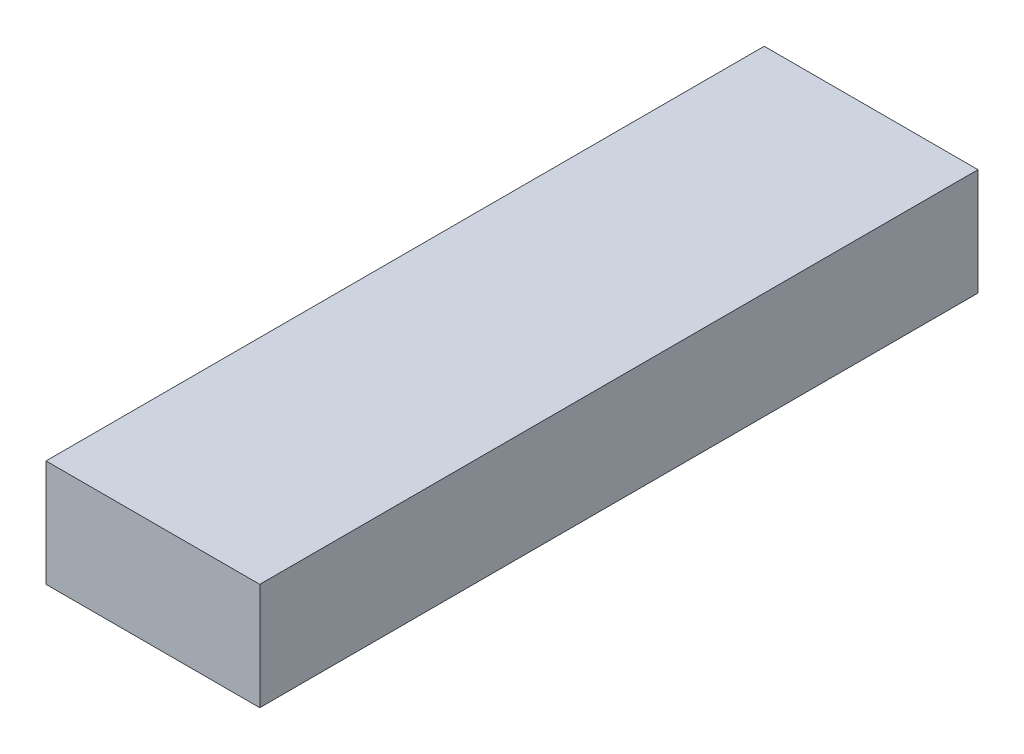
ISO-10303-21;
HEADER;
FILE_DESCRIPTION(('STEP AP214'),'2;1');
FILE_NAME('part.step','',(''),(''),'','','');
FILE_SCHEMA(('AUTOMOTIVE_DESIGN { 1 0 10303 214 1 1 1 1 }'));
ENDSEC;
DATA;
#1=APPLICATION_CONTEXT('core data for automotive mechanical design processes');
#2=APPLICATION_PROTOCOL_DEFINITION('international standard','automotive_design',2000,#1);
#3=PRODUCT_CONTEXT('',#1,'mechanical');
#4=PRODUCT('Part','Part','',(#3));
#5=PRODUCT_RELATED_PRODUCT_CATEGORY('part','',(#4));
#6=PRODUCT_DEFINITION_FORMATION('','',#4);
#7=PRODUCT_DEFINITION_CONTEXT('part definition',#1,'design');
#8=PRODUCT_DEFINITION('design','',#6,#7);
#9=PRODUCT_DEFINITION_SHAPE('','',#8);
#10=(LENGTH_UNIT() NAMED_UNIT(*) SI_UNIT(.MILLI.,.METRE.));
#11=(NAMED_UNIT(*) PLANE_ANGLE_UNIT() SI_UNIT($,.RADIAN.));
#12=(NAMED_UNIT(*) SI_UNIT($,.STERADIAN.) SOLID_ANGLE_UNIT());
#13=UNCERTAINTY_MEASURE_WITH_UNIT(LENGTH_MEASURE(1.E-05),#10,'distance_accuracy_value','');
#14=(GEOMETRIC_REPRESENTATION_CONTEXT(3) GLOBAL_UNCERTAINTY_ASSIGNED_CONTEXT((#13)) GLOBAL_UNIT_ASSIGNED_CONTEXT((#10,
#11,#12)) REPRESENTATION_CONTEXT('',''));
#15=CARTESIAN_POINT('',(0.,0.,0.));
#16=DIRECTION('',(0.,0.,1.));
#17=DIRECTION('',(1.,0.,0.));
#18=AXIS2_PLACEMENT_3D('',#15,#16,#17);
#19=CARTESIAN_POINT('',(2.97165317919075,3.175,-4.8671098265896));
#20=DIRECTION('',(0.,0.,1.));
#21=DIRECTION('',(1.,0.,0.));
#22=AXIS2_PLACEMENT_3D('',#19,#20,#21);
#23=PLANE('',#22);
#24=DIRECTION('',(-1.,0.,0.));
#25=VECTOR('',#24,1.);
#26=CARTESIAN_POINT('',(2.97165317919075,0.,-4.8671098265896));
#27=LINE('',#26,#25);
#28=CARTESIAN_POINT('',(2.97165317919075,0.,-4.8671098265896));
#29=VERTEX_POINT('',#28);
#30=CARTESIAN_POINT('',(-3.37834682080925,0.,-4.8671098265896));
#31=VERTEX_POINT('',#30);
#32=EDGE_CURVE('E96',#29,#31,#27,.T.);
#33=ORIENTED_EDGE('',*,*,#32,.T.);
#34=DIRECTION('',(0.,-1.,0.));
#35=VECTOR('',#34,1.);
#36=CARTESIAN_POINT('',(-3.37834682080925,3.175,-4.8671098265896));
#37=LINE('',#36,#35);
#38=CARTESIAN_POINT('',(-3.37834682080925,3.175,-4.8671098265896));
#39=VERTEX_POINT('',#38);
#40=EDGE_CURVE('E11',#39,#31,#37,.T.);
#41=ORIENTED_EDGE('',*,*,#40,.F.);
#42=DIRECTION('',(-1.,0.,0.));
#43=VECTOR('',#42,1.);
#44=CARTESIAN_POINT('',(2.97165317919075,3.175,-4.8671098265896));
#45=LINE('',#44,#43);
#46=CARTESIAN_POINT('',(2.97165317919075,3.175,-4.8671098265896));
#47=VERTEX_POINT('',#46);
#48=EDGE_CURVE('E84',#47,#39,#45,.T.);
#49=ORIENTED_EDGE('',*,*,#48,.F.);
#50=DIRECTION('',(0.,-1.,0.));
#51=VECTOR('',#50,1.);
#52=CARTESIAN_POINT('',(2.97165317919075,3.175,-4.8671098265896));
#53=LINE('',#52,#51);
#54=EDGE_CURVE('E92',#47,#29,#53,.T.);
#55=ORIENTED_EDGE('',*,*,#54,.T.);
#56=EDGE_LOOP('',(#33,#41,#49,#55));
#57=FACE_BOUND('',#56,.T.);
#58=ADVANCED_FACE('F33',(#57),#23,.F.);
#59=CARTESIAN_POINT('',(-3.37834682080925,3.175,-4.8671098265896));
#60=DIRECTION('',(1.,0.,0.));
#61=DIRECTION('',(0.,0.,-1.));
#62=AXIS2_PLACEMENT_3D('',#59,#60,#61);
#63=PLANE('',#62);
#64=DIRECTION('',(0.,0.,1.));
#65=VECTOR('',#64,1.);
#66=CARTESIAN_POINT('',(-3.37834682080925,0.,-4.8671098265896));
#67=LINE('',#66,#65);
#68=CARTESIAN_POINT('',(-3.37834682080925,0.,16.4688901734104));
#69=VERTEX_POINT('',#68);
#70=EDGE_CURVE('E88',#31,#69,#67,.T.);
#71=ORIENTED_EDGE('',*,*,#70,.T.);
#72=DIRECTION('',(0.,-1.,0.));
#73=VECTOR('',#72,1.);
#74=CARTESIAN_POINT('',(-3.37834682080925,3.175,16.4688901734104));
#75=LINE('',#74,#73);
#76=CARTESIAN_POINT('',(-3.37834682080925,3.175,16.4688901734104));
#77=VERTEX_POINT('',#76);
#78=EDGE_CURVE('E41',#77,#69,#75,.T.);
#79=ORIENTED_EDGE('',*,*,#78,.F.);
#80=DIRECTION('',(0.,0.,1.));
#81=VECTOR('',#80,1.);
#82=CARTESIAN_POINT('',(-3.37834682080925,3.175,-4.8671098265896));
#83=LINE('',#82,#81);
#84=EDGE_CURVE('E79',#39,#77,#83,.T.);
#85=ORIENTED_EDGE('',*,*,#84,.F.);
#86=ORIENTED_EDGE('',*,*,#40,.T.);
#87=EDGE_LOOP('',(#71,#79,#85,#86));
#88=FACE_BOUND('',#87,.T.);
#89=ADVANCED_FACE('F87',(#88),#63,.F.);
#90=CARTESIAN_POINT('',(-3.37834682080925,3.175,16.4688901734104));
#91=DIRECTION('',(0.,0.,-1.));
#92=DIRECTION('',(-1.,0.,0.));
#93=AXIS2_PLACEMENT_3D('',#90,#91,#92);
#94=PLANE('',#93);
#95=DIRECTION('',(1.,0.,0.));
#96=VECTOR('',#95,1.);
#97=CARTESIAN_POINT('',(-3.37834682080925,0.,16.4688901734104));
#98=LINE('',#97,#96);
#99=CARTESIAN_POINT('',(2.97165317919075,0.,16.4688901734104));
#100=VERTEX_POINT('',#99);
#101=EDGE_CURVE('E66',#69,#100,#98,.T.);
#102=ORIENTED_EDGE('',*,*,#101,.T.);
#103=DIRECTION('',(0.,-1.,0.));
#104=VECTOR('',#103,1.);
#105=CARTESIAN_POINT('',(2.97165317919075,3.175,16.4688901734104));
#106=LINE('',#105,#104);
#107=CARTESIAN_POINT('',(2.97165317919075,3.175,16.4688901734104));
#108=VERTEX_POINT('',#107);
#109=EDGE_CURVE('E89',#108,#100,#106,.T.);
#110=ORIENTED_EDGE('',*,*,#109,.F.);
#111=DIRECTION('',(1.,0.,0.));
#112=VECTOR('',#111,1.);
#113=CARTESIAN_POINT('',(-3.37834682080925,3.175,16.4688901734104));
#114=LINE('',#113,#112);
#115=EDGE_CURVE('E82',#77,#108,#114,.T.);
#116=ORIENTED_EDGE('',*,*,#115,.F.);
#117=ORIENTED_EDGE('',*,*,#78,.T.);
#118=EDGE_LOOP('',(#102,#110,#116,#117));
#119=FACE_BOUND('',#118,.T.);
#120=ADVANCED_FACE('F90',(#119),#94,.F.);
#121=CARTESIAN_POINT('',(2.97165317919075,3.175,16.4688901734104));
#122=DIRECTION('',(-1.,0.,0.));
#123=DIRECTION('',(0.,0.,1.));
#124=AXIS2_PLACEMENT_3D('',#121,#122,#123);
#125=PLANE('',#124);
#126=DIRECTION('',(0.,0.,-1.));
#127=VECTOR('',#126,1.);
#128=CARTESIAN_POINT('',(2.97165317919075,0.,16.4688901734104));
#129=LINE('',#128,#127);
#130=EDGE_CURVE('E72',#100,#29,#129,.T.);
#131=ORIENTED_EDGE('',*,*,#130,.T.);
#132=ORIENTED_EDGE('',*,*,#54,.F.);
#133=DIRECTION('',(0.,0.,-1.));
#134=VECTOR('',#133,1.);
#135=CARTESIAN_POINT('',(2.97165317919075,3.175,16.4688901734104));
#136=LINE('',#135,#134);
#137=EDGE_CURVE('E49',#108,#47,#136,.T.);
#138=ORIENTED_EDGE('',*,*,#137,.F.);
#139=ORIENTED_EDGE('',*,*,#109,.T.);
#140=EDGE_LOOP('',(#131,#132,#138,#139));
#141=FACE_BOUND('',#140,.T.);
#142=ADVANCED_FACE('F103',(#141),#125,.F.);
#143=CARTESIAN_POINT('',(0.,3.175,0.));
#144=DIRECTION('',(0.,1.,0.));
#145=DIRECTION('',(0.,0.,1.));
#146=AXIS2_PLACEMENT_3D('',#143,#144,#145);
#147=PLANE('',#146);
#148=ORIENTED_EDGE('',*,*,#48,.T.);
#149=ORIENTED_EDGE('',*,*,#84,.T.);
#150=ORIENTED_EDGE('',*,*,#115,.T.);
#151=ORIENTED_EDGE('',*,*,#137,.T.);
#152=EDGE_LOOP('',(#148,#149,#150,#151));
#153=FACE_BOUND('',#152,.T.);
#154=ADVANCED_FACE('F80',(#153),#147,.T.);
#155=CARTESIAN_POINT('',(0.,0.,0.));
#156=DIRECTION('',(0.,1.,0.));
#157=DIRECTION('',(0.,0.,1.));
#158=AXIS2_PLACEMENT_3D('',#155,#156,#157);
#159=PLANE('',#158);
#160=ORIENTED_EDGE('',*,*,#32,.F.);
#161=ORIENTED_EDGE('',*,*,#130,.F.);
#162=ORIENTED_EDGE('',*,*,#101,.F.);
#163=ORIENTED_EDGE('',*,*,#70,.F.);
#164=EDGE_LOOP('',(#160,#161,#162,#163));
#165=FACE_BOUND('',#164,.T.);
#166=ADVANCED_FACE('F106',(#165),#159,.F.);
#167=CLOSED_SHELL('',(#58,#89,#120,#142,#154,#166));
#168=MANIFOLD_SOLID_BREP('B2',#167);
#169=ADVANCED_BREP_SHAPE_REPRESENTATION('',(#18,#168),#14);
#170=SHAPE_DEFINITION_REPRESENTATION(#9,#169);
ENDSEC;
END-ISO-10303-21;
